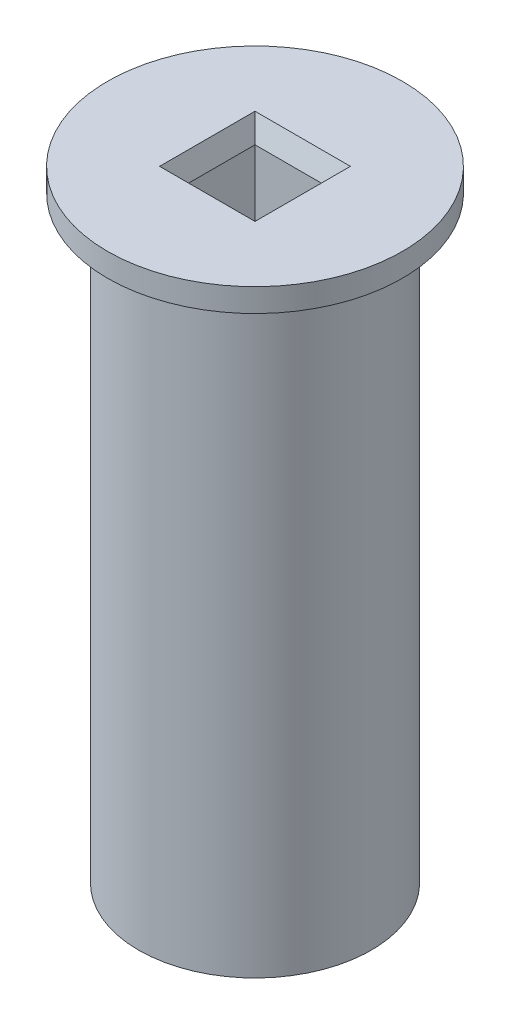
ISO-10303-21;
HEADER;
FILE_DESCRIPTION(('STEP AP214'),'2;1');
FILE_NAME('part.step','',(''),(''),'','','');
FILE_SCHEMA(('AUTOMOTIVE_DESIGN { 1 0 10303 214 1 1 1 1 }'));
ENDSEC;
DATA;
#1=APPLICATION_CONTEXT('core data for automotive mechanical design processes');
#2=APPLICATION_PROTOCOL_DEFINITION('international standard','automotive_design',2000,#1);
#3=PRODUCT_CONTEXT('',#1,'mechanical');
#4=PRODUCT('Part','Part','',(#3));
#5=PRODUCT_RELATED_PRODUCT_CATEGORY('part','',(#4));
#6=PRODUCT_DEFINITION_FORMATION('','',#4);
#7=PRODUCT_DEFINITION_CONTEXT('part definition',#1,'design');
#8=PRODUCT_DEFINITION('design','',#6,#7);
#9=PRODUCT_DEFINITION_SHAPE('','',#8);
#10=(LENGTH_UNIT() NAMED_UNIT(*) SI_UNIT(.MILLI.,.METRE.));
#11=(NAMED_UNIT(*) PLANE_ANGLE_UNIT() SI_UNIT($,.RADIAN.));
#12=(NAMED_UNIT(*) SI_UNIT($,.STERADIAN.) SOLID_ANGLE_UNIT());
#13=UNCERTAINTY_MEASURE_WITH_UNIT(LENGTH_MEASURE(1.E-05),#10,'distance_accuracy_value','');
#14=(GEOMETRIC_REPRESENTATION_CONTEXT(3) GLOBAL_UNCERTAINTY_ASSIGNED_CONTEXT((#13)) GLOBAL_UNIT_ASSIGNED_CONTEXT((#10,
#11,#12)) REPRESENTATION_CONTEXT('',''));
#15=CARTESIAN_POINT('',(0.,0.,0.));
#16=DIRECTION('',(0.,0.,1.));
#17=DIRECTION('',(1.,0.,0.));
#18=AXIS2_PLACEMENT_3D('',#15,#16,#17);
#19=CARTESIAN_POINT('',(0.,80.,0.));
#20=DIRECTION('',(0.,-1.,0.));
#21=DIRECTION('',(0.,0.,-1.));
#22=AXIS2_PLACEMENT_3D('',#19,#20,#21);
#23=CYLINDRICAL_SURFACE('',#22,15.);
#24=CARTESIAN_POINT('',(0.,0.,0.));
#25=DIRECTION('',(0.,1.,0.));
#26=DIRECTION('',(0.,0.,1.));
#27=AXIS2_PLACEMENT_3D('',#24,#25,#26);
#28=CIRCLE('',#27,15.);
#29=CARTESIAN_POINT('',(0.,0.,15.));
#30=VERTEX_POINT('',#29);
#31=EDGE_CURVE('E99',#30,#30,#28,.T.);
#32=ORIENTED_EDGE('',*,*,#31,.T.);
#33=EDGE_LOOP('',(#32));
#34=FACE_BOUND('',#33,.T.);
#35=CARTESIAN_POINT('',(0.,77.,0.));
#36=DIRECTION('',(0.,1.,0.));
#37=DIRECTION('',(0.,0.,1.));
#38=AXIS2_PLACEMENT_3D('',#35,#36,#37);
#39=CIRCLE('',#38,15.);
#40=CARTESIAN_POINT('',(0.,77.,15.));
#41=VERTEX_POINT('',#40);
#42=EDGE_CURVE('E120',#41,#41,#39,.T.);
#43=ORIENTED_EDGE('',*,*,#42,.F.);
#44=EDGE_LOOP('',(#43));
#45=FACE_BOUND('',#44,.T.);
#46=ADVANCED_FACE('F40',(#34,#45),#23,.T.);
#47=CARTESIAN_POINT('',(0.,80.,0.));
#48=DIRECTION('',(0.,1.,0.));
#49=DIRECTION('',(0.,0.,1.));
#50=AXIS2_PLACEMENT_3D('',#47,#48,#49);
#51=PLANE('',#50);
#52=DIRECTION('',(1.,0.,0.));
#53=VECTOR('',#52,1.);
#54=CARTESIAN_POINT('',(0.,80.,-6.14999999999999));
#55=LINE('',#54,#53);
#56=CARTESIAN_POINT('',(-6.14999999999999,80.,-6.14999999999999));
#57=VERTEX_POINT('',#56);
#58=CARTESIAN_POINT('',(6.15,80.,-6.14999999999999));
#59=VERTEX_POINT('',#58);
#60=EDGE_CURVE('E136',#57,#59,#55,.T.);
#61=ORIENTED_EDGE('',*,*,#60,.T.);
#62=DIRECTION('',(0.,0.,1.));
#63=VECTOR('',#62,1.);
#64=CARTESIAN_POINT('',(6.15,80.,0.));
#65=LINE('',#64,#63);
#66=CARTESIAN_POINT('',(6.15,80.,6.15));
#67=VERTEX_POINT('',#66);
#68=EDGE_CURVE('E142',#59,#67,#65,.T.);
#69=ORIENTED_EDGE('',*,*,#68,.T.);
#70=DIRECTION('',(-1.,0.,0.));
#71=VECTOR('',#70,1.);
#72=CARTESIAN_POINT('',(0.,80.,6.15));
#73=LINE('',#72,#71);
#74=CARTESIAN_POINT('',(-6.14999999999999,80.,6.15));
#75=VERTEX_POINT('',#74);
#76=EDGE_CURVE('E140',#67,#75,#73,.T.);
#77=ORIENTED_EDGE('',*,*,#76,.T.);
#78=DIRECTION('',(0.,0.,-1.));
#79=VECTOR('',#78,1.);
#80=CARTESIAN_POINT('',(-6.14999999999999,80.,0.));
#81=LINE('',#80,#79);
#82=EDGE_CURVE('E138',#75,#57,#81,.T.);
#83=ORIENTED_EDGE('',*,*,#82,.T.);
#84=EDGE_LOOP('',(#61,#69,#77,#83));
#85=FACE_BOUND('',#84,.T.);
#86=CARTESIAN_POINT('',(0.,80.,0.));
#87=DIRECTION('',(0.,1.,0.));
#88=DIRECTION('',(0.,0.,1.));
#89=AXIS2_PLACEMENT_3D('',#86,#87,#88);
#90=CIRCLE('',#89,19.);
#91=CARTESIAN_POINT('',(0.,80.,19.));
#92=VERTEX_POINT('',#91);
#93=EDGE_CURVE('E117',#92,#92,#90,.T.);
#94=ORIENTED_EDGE('',*,*,#93,.T.);
#95=EDGE_LOOP('',(#94));
#96=FACE_BOUND('',#95,.T.);
#97=ADVANCED_FACE('F164',(#85,#96),#51,.T.);
#98=CARTESIAN_POINT('',(0.,0.,0.));
#99=DIRECTION('',(0.,1.,0.));
#100=DIRECTION('',(0.,0.,1.));
#101=AXIS2_PLACEMENT_3D('',#98,#99,#100);
#102=PLANE('',#101);
#103=ORIENTED_EDGE('',*,*,#31,.F.);
#104=EDGE_LOOP('',(#103));
#105=FACE_BOUND('',#104,.T.);
#106=DIRECTION('',(0.,0.,1.));
#107=VECTOR('',#106,1.);
#108=CARTESIAN_POINT('',(-5.15,0.,5.15));
#109=LINE('',#108,#107);
#110=CARTESIAN_POINT('',(-5.15,0.,-5.15));
#111=VERTEX_POINT('',#110);
#112=CARTESIAN_POINT('',(-5.15,0.,5.15));
#113=VERTEX_POINT('',#112);
#114=EDGE_CURVE('E95',#111,#113,#109,.T.);
#115=ORIENTED_EDGE('',*,*,#114,.T.);
#116=DIRECTION('',(1.,0.,0.));
#117=VECTOR('',#116,1.);
#118=CARTESIAN_POINT('',(5.15,0.,5.15));
#119=LINE('',#118,#117);
#120=CARTESIAN_POINT('',(5.15,0.,5.15));
#121=VERTEX_POINT('',#120);
#122=EDGE_CURVE('E103',#113,#121,#119,.T.);
#123=ORIENTED_EDGE('',*,*,#122,.T.);
#124=DIRECTION('',(0.,0.,-1.));
#125=VECTOR('',#124,1.);
#126=CARTESIAN_POINT('',(5.15,0.,5.15));
#127=LINE('',#126,#125);
#128=CARTESIAN_POINT('',(5.15,0.,-5.15));
#129=VERTEX_POINT('',#128);
#130=EDGE_CURVE('E109',#121,#129,#127,.T.);
#131=ORIENTED_EDGE('',*,*,#130,.T.);
#132=DIRECTION('',(-1.,0.,0.));
#133=VECTOR('',#132,1.);
#134=CARTESIAN_POINT('',(5.15,0.,-5.15));
#135=LINE('',#134,#133);
#136=EDGE_CURVE('E113',#129,#111,#135,.T.);
#137=ORIENTED_EDGE('',*,*,#136,.T.);
#138=EDGE_LOOP('',(#115,#123,#131,#137));
#139=FACE_BOUND('',#138,.T.);
#140=ADVANCED_FACE('F111',(#105,#139),#102,.F.);
#141=CARTESIAN_POINT('',(-5.15,80.,5.15));
#142=DIRECTION('',(1.,0.,0.));
#143=DIRECTION('',(0.,0.,-1.));
#144=AXIS2_PLACEMENT_3D('',#141,#142,#143);
#145=PLANE('',#144);
#146=DIRECTION('',(0.,-1.,0.));
#147=VECTOR('',#146,1.);
#148=CARTESIAN_POINT('',(-5.15,80.,-5.15));
#149=LINE('',#148,#147);
#150=CARTESIAN_POINT('',(-5.15,77.2525225805454,-5.15));
#151=VERTEX_POINT('',#150);
#152=EDGE_CURVE('E125',#151,#111,#149,.T.);
#153=ORIENTED_EDGE('',*,*,#152,.F.);
#154=DIRECTION('',(0.,0.,1.));
#155=VECTOR('',#154,1.);
#156=CARTESIAN_POINT('',(-5.15,77.2525225805454,5.15));
#157=LINE('',#156,#155);
#158=CARTESIAN_POINT('',(-5.15,77.2525225805454,5.15));
#159=VERTEX_POINT('',#158);
#160=EDGE_CURVE('E49',#151,#159,#157,.T.);
#161=ORIENTED_EDGE('',*,*,#160,.T.);
#162=DIRECTION('',(0.,-1.,0.));
#163=VECTOR('',#162,1.);
#164=CARTESIAN_POINT('',(-5.15,80.,5.15));
#165=LINE('',#164,#163);
#166=EDGE_CURVE('E91',#159,#113,#165,.T.);
#167=ORIENTED_EDGE('',*,*,#166,.T.);
#168=ORIENTED_EDGE('',*,*,#114,.F.);
#169=EDGE_LOOP('',(#153,#161,#167,#168));
#170=FACE_BOUND('',#169,.T.);
#171=ADVANCED_FACE('F93',(#170),#145,.T.);
#172=CARTESIAN_POINT('',(5.15,80.,5.15));
#173=DIRECTION('',(0.,0.,-1.));
#174=DIRECTION('',(-1.,0.,0.));
#175=AXIS2_PLACEMENT_3D('',#172,#173,#174);
#176=PLANE('',#175);
#177=ORIENTED_EDGE('',*,*,#166,.F.);
#178=DIRECTION('',(1.,0.,0.));
#179=VECTOR('',#178,1.);
#180=CARTESIAN_POINT('',(5.15,77.2525225805454,5.15));
#181=LINE('',#180,#179);
#182=CARTESIAN_POINT('',(5.15,77.2525225805454,5.15));
#183=VERTEX_POINT('',#182);
#184=EDGE_CURVE('E145',#159,#183,#181,.T.);
#185=ORIENTED_EDGE('',*,*,#184,.T.);
#186=DIRECTION('',(0.,-1.,0.));
#187=VECTOR('',#186,1.);
#188=CARTESIAN_POINT('',(5.15,80.,5.15));
#189=LINE('',#188,#187);
#190=EDGE_CURVE('E100',#183,#121,#189,.T.);
#191=ORIENTED_EDGE('',*,*,#190,.T.);
#192=ORIENTED_EDGE('',*,*,#122,.F.);
#193=EDGE_LOOP('',(#177,#185,#191,#192));
#194=FACE_BOUND('',#193,.T.);
#195=ADVANCED_FACE('F104',(#194),#176,.T.);
#196=CARTESIAN_POINT('',(5.15,80.,5.15));
#197=DIRECTION('',(-1.,0.,0.));
#198=DIRECTION('',(0.,0.,1.));
#199=AXIS2_PLACEMENT_3D('',#196,#197,#198);
#200=PLANE('',#199);
#201=ORIENTED_EDGE('',*,*,#190,.F.);
#202=DIRECTION('',(0.,0.,-1.));
#203=VECTOR('',#202,1.);
#204=CARTESIAN_POINT('',(5.15,77.2525225805454,5.15));
#205=LINE('',#204,#203);
#206=CARTESIAN_POINT('',(5.15,77.2525225805454,-5.15));
#207=VERTEX_POINT('',#206);
#208=EDGE_CURVE('E133',#183,#207,#205,.T.);
#209=ORIENTED_EDGE('',*,*,#208,.T.);
#210=DIRECTION('',(0.,-1.,0.));
#211=VECTOR('',#210,1.);
#212=CARTESIAN_POINT('',(5.15,80.,-5.15));
#213=LINE('',#212,#211);
#214=EDGE_CURVE('E127',#207,#129,#213,.T.);
#215=ORIENTED_EDGE('',*,*,#214,.T.);
#216=ORIENTED_EDGE('',*,*,#130,.F.);
#217=EDGE_LOOP('',(#201,#209,#215,#216));
#218=FACE_BOUND('',#217,.T.);
#219=ADVANCED_FACE('F256',(#218),#200,.T.);
#220=CARTESIAN_POINT('',(5.15,80.,-5.15));
#221=DIRECTION('',(0.,0.,1.));
#222=DIRECTION('',(1.,0.,0.));
#223=AXIS2_PLACEMENT_3D('',#220,#221,#222);
#224=PLANE('',#223);
#225=ORIENTED_EDGE('',*,*,#214,.F.);
#226=DIRECTION('',(-1.,0.,0.));
#227=VECTOR('',#226,1.);
#228=CARTESIAN_POINT('',(5.15,77.2525225805454,-5.15));
#229=LINE('',#228,#227);
#230=EDGE_CURVE('E11',#207,#151,#229,.T.);
#231=ORIENTED_EDGE('',*,*,#230,.T.);
#232=ORIENTED_EDGE('',*,*,#152,.T.);
#233=ORIENTED_EDGE('',*,*,#136,.F.);
#234=EDGE_LOOP('',(#225,#231,#232,#233));
#235=FACE_BOUND('',#234,.T.);
#236=ADVANCED_FACE('F177',(#235),#224,.T.);
#237=CARTESIAN_POINT('',(0.,77.,0.));
#238=DIRECTION('',(0.,1.,0.));
#239=DIRECTION('',(0.,0.,1.));
#240=AXIS2_PLACEMENT_3D('',#237,#238,#239);
#241=PLANE('',#240);
#242=CARTESIAN_POINT('',(0.,77.,0.));
#243=DIRECTION('',(0.,1.,0.));
#244=DIRECTION('',(0.,0.,1.));
#245=AXIS2_PLACEMENT_3D('',#242,#243,#244);
#246=CIRCLE('',#245,19.);
#247=CARTESIAN_POINT('',(0.,77.,19.));
#248=VERTEX_POINT('',#247);
#249=EDGE_CURVE('E114',#248,#248,#246,.T.);
#250=ORIENTED_EDGE('',*,*,#249,.F.);
#251=EDGE_LOOP('',(#250));
#252=FACE_BOUND('',#251,.T.);
#253=ORIENTED_EDGE('',*,*,#42,.T.);
#254=EDGE_LOOP('',(#253));
#255=FACE_BOUND('',#254,.T.);
#256=ADVANCED_FACE('F168',(#252,#255),#241,.F.);
#257=CARTESIAN_POINT('',(0.,77.,0.));
#258=DIRECTION('',(0.,1.,0.));
#259=DIRECTION('',(0.,0.,1.));
#260=AXIS2_PLACEMENT_3D('',#257,#258,#259);
#261=CYLINDRICAL_SURFACE('',#260,19.);
#262=ORIENTED_EDGE('',*,*,#249,.T.);
#263=EDGE_LOOP('',(#262));
#264=FACE_BOUND('',#263,.T.);
#265=ORIENTED_EDGE('',*,*,#93,.F.);
#266=EDGE_LOOP('',(#265));
#267=FACE_BOUND('',#266,.T.);
#268=ADVANCED_FACE('F166',(#264,#267),#261,.T.);
#269=CARTESIAN_POINT('',(-5.15,77.2525225805454,5.15));
#270=DIRECTION('',(-0.939692620785909,-0.342020143325667,0.));
#271=DIRECTION('',(0.,0.,1.));
#272=AXIS2_PLACEMENT_3D('',#269,#270,#271);
#273=PLANE('',#272);
#274=DIRECTION('',(0.323615577118183,-0.889126490715989,0.323615577118183));
#275=VECTOR('',#274,1.);
#276=CARTESIAN_POINT('',(-4.07131146993859,74.2888502015769,-4.07131146993859));
#277=LINE('',#276,#275);
#278=EDGE_CURVE('E151',#57,#151,#277,.T.);
#279=ORIENTED_EDGE('',*,*,#278,.F.);
#280=ORIENTED_EDGE('',*,*,#82,.F.);
#281=DIRECTION('',(0.323615577118183,-0.889126490715989,-0.323615577118183));
#282=VECTOR('',#281,1.);
#283=CARTESIAN_POINT('',(-4.07131146993859,74.2888502015769,4.07131146993859));
#284=LINE('',#283,#282);
#285=EDGE_CURVE('E44',#159,#75,#284,.F.);
#286=ORIENTED_EDGE('',*,*,#285,.F.);
#287=ORIENTED_EDGE('',*,*,#160,.F.);
#288=EDGE_LOOP('',(#279,#280,#286,#287));
#289=FACE_BOUND('',#288,.T.);
#290=ADVANCED_FACE('F42',(#289),#273,.F.);
#291=CARTESIAN_POINT('',(5.15,77.2525225805454,5.15));
#292=DIRECTION('',(0.,-0.342020143325667,0.939692620785909));
#293=DIRECTION('',(1.,0.,0.));
#294=AXIS2_PLACEMENT_3D('',#291,#292,#293);
#295=PLANE('',#294);
#296=ORIENTED_EDGE('',*,*,#285,.T.);
#297=ORIENTED_EDGE('',*,*,#76,.F.);
#298=DIRECTION('',(-0.323615577118183,-0.889126490715989,-0.323615577118183));
#299=VECTOR('',#298,1.);
#300=CARTESIAN_POINT('',(5.15,77.2525225805454,5.15));
#301=LINE('',#300,#299);
#302=EDGE_CURVE('E150',#183,#67,#301,.F.);
#303=ORIENTED_EDGE('',*,*,#302,.F.);
#304=ORIENTED_EDGE('',*,*,#184,.F.);
#305=EDGE_LOOP('',(#296,#297,#303,#304));
#306=FACE_BOUND('',#305,.T.);
#307=ADVANCED_FACE('F175',(#306),#295,.F.);
#308=CARTESIAN_POINT('',(5.15,77.2525225805454,-5.15));
#309=DIRECTION('',(0.,-0.342020143325667,-0.939692620785909));
#310=DIRECTION('',(-1.,0.,0.));
#311=AXIS2_PLACEMENT_3D('',#308,#309,#310);
#312=PLANE('',#311);
#313=ORIENTED_EDGE('',*,*,#278,.T.);
#314=ORIENTED_EDGE('',*,*,#230,.F.);
#315=DIRECTION('',(0.323615577118183,0.889126490715989,-0.323615577118183));
#316=VECTOR('',#315,1.);
#317=CARTESIAN_POINT('',(4.07131146993859,74.2888502015769,-4.07131146993859));
#318=LINE('',#317,#316);
#319=EDGE_CURVE('E148',#59,#207,#318,.F.);
#320=ORIENTED_EDGE('',*,*,#319,.F.);
#321=ORIENTED_EDGE('',*,*,#60,.F.);
#322=EDGE_LOOP('',(#313,#314,#320,#321));
#323=FACE_BOUND('',#322,.T.);
#324=ADVANCED_FACE('F195',(#323),#312,.F.);
#325=CARTESIAN_POINT('',(5.15,77.2525225805454,5.15));
#326=DIRECTION('',(0.939692620785909,-0.342020143325667,0.));
#327=DIRECTION('',(0.,0.,-1.));
#328=AXIS2_PLACEMENT_3D('',#325,#326,#327);
#329=PLANE('',#328);
#330=ORIENTED_EDGE('',*,*,#302,.T.);
#331=ORIENTED_EDGE('',*,*,#68,.F.);
#332=ORIENTED_EDGE('',*,*,#319,.T.);
#333=ORIENTED_EDGE('',*,*,#208,.F.);
#334=EDGE_LOOP('',(#330,#331,#332,#333));
#335=FACE_BOUND('',#334,.T.);
#336=ADVANCED_FACE('F192',(#335),#329,.F.);
#337=CLOSED_SHELL('',(#46,#97,#140,#171,#195,#219,#236,#256,#268,#290,#307,#324,#336));
#338=MANIFOLD_SOLID_BREP('B2',#337);
#339=ADVANCED_BREP_SHAPE_REPRESENTATION('',(#18,#338),#14);
#340=SHAPE_DEFINITION_REPRESENTATION(#9,#339);
ENDSEC;
END-ISO-10303-21;
